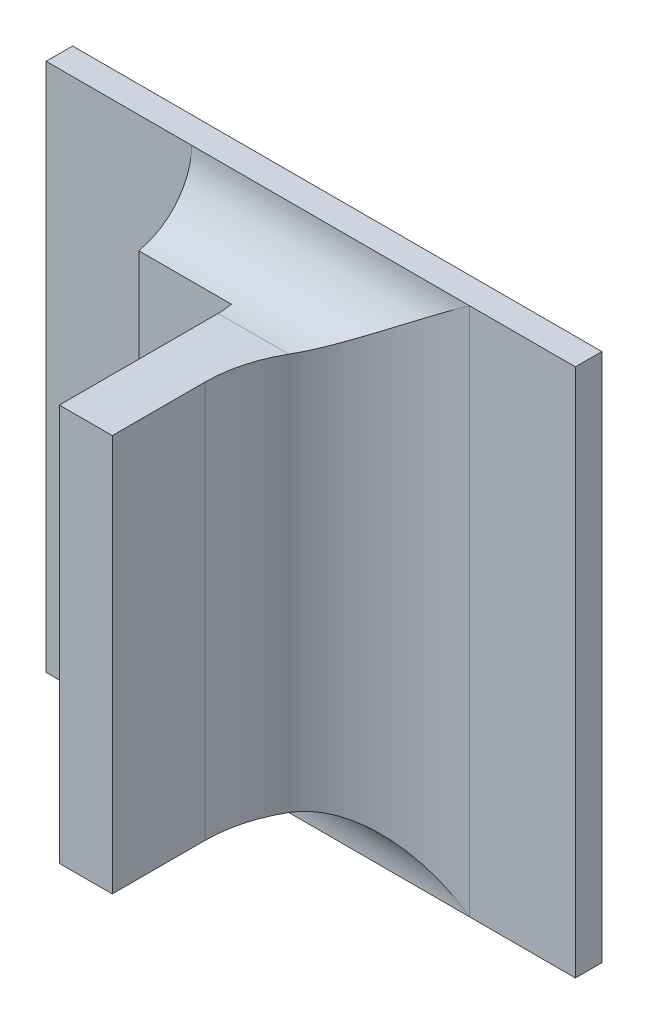
ISO-10303-21;
HEADER;
FILE_DESCRIPTION(('STEP AP214'),'2;1');
FILE_NAME('part.step','',(''),(''),'','','');
FILE_SCHEMA(('AUTOMOTIVE_DESIGN { 1 0 10303 214 1 1 1 1 }'));
ENDSEC;
DATA;
#1=APPLICATION_CONTEXT('core data for automotive mechanical design processes');
#2=APPLICATION_PROTOCOL_DEFINITION('international standard','automotive_design',2000,#1);
#3=PRODUCT_CONTEXT('',#1,'mechanical');
#4=PRODUCT('Part','Part','',(#3));
#5=PRODUCT_RELATED_PRODUCT_CATEGORY('part','',(#4));
#6=PRODUCT_DEFINITION_FORMATION('','',#4);
#7=PRODUCT_DEFINITION_CONTEXT('part definition',#1,'design');
#8=PRODUCT_DEFINITION('design','',#6,#7);
#9=PRODUCT_DEFINITION_SHAPE('','',#8);
#10=(LENGTH_UNIT() NAMED_UNIT(*) SI_UNIT(.MILLI.,.METRE.));
#11=(NAMED_UNIT(*) PLANE_ANGLE_UNIT() SI_UNIT($,.RADIAN.));
#12=(NAMED_UNIT(*) SI_UNIT($,.STERADIAN.) SOLID_ANGLE_UNIT());
#13=UNCERTAINTY_MEASURE_WITH_UNIT(LENGTH_MEASURE(1.E-05),#10,'distance_accuracy_value','');
#14=(GEOMETRIC_REPRESENTATION_CONTEXT(3) GLOBAL_UNCERTAINTY_ASSIGNED_CONTEXT((#13)) GLOBAL_UNIT_ASSIGNED_CONTEXT((#10,
#11,#12)) REPRESENTATION_CONTEXT('',''));
#15=CARTESIAN_POINT('',(0.,0.,0.));
#16=DIRECTION('',(0.,0.,1.));
#17=DIRECTION('',(1.,0.,0.));
#18=AXIS2_PLACEMENT_3D('',#15,#16,#17);
#19=CARTESIAN_POINT('',(-0.924341450663713,-0.311549667580546,0.0796271653543306));
#20=DIRECTION('',(-1.,0.,0.));
#21=DIRECTION('',(0.,-1.,0.));
#22=AXIS2_PLACEMENT_3D('',#19,#20,#21);
#23=PLANE('',#22);
#24=DIRECTION('',(0.,-1.,0.));
#25=VECTOR('',#24,1.);
#26=CARTESIAN_POINT('',(-0.924341450663713,-0.36005360458842,0.0800681102362204));
#27=LINE('',#26,#25);
#28=CARTESIAN_POINT('',(-0.924341450663713,-0.351234706950624,0.0800681102362204));
#29=VERTEX_POINT('',#28);
#30=CARTESIAN_POINT('',(-0.924341450663713,-0.313439431360073,0.0800681102362204));
#31=VERTEX_POINT('',#30);
#32=EDGE_CURVE('E116',#29,#31,#27,.F.);
#33=ORIENTED_EDGE('',*,*,#32,.T.);
#34=DIRECTION('',(0.,0.,1.));
#35=VECTOR('',#34,1.);
#36=CARTESIAN_POINT('',(-0.924341450663713,-0.313439431360073,0.0730129921259841));
#37=LINE('',#36,#35);
#38=CARTESIAN_POINT('',(-0.924341450663713,-0.313439431360073,0.0888870078740156));
#39=VERTEX_POINT('',#38);
#40=EDGE_CURVE('E294',#39,#31,#37,.F.);
#41=ORIENTED_EDGE('',*,*,#40,.F.);
#42=DIRECTION('',(0.,1.,0.));
#43=VECTOR('',#42,1.);
#44=CARTESIAN_POINT('',(-0.924341450663713,-0.311549667580546,0.0888870078740156));
#45=LINE('',#44,#43);
#46=CARTESIAN_POINT('',(-0.924341450663713,-0.351234706950624,0.0888870078740156));
#47=VERTEX_POINT('',#46);
#48=EDGE_CURVE('E306',#39,#47,#45,.F.);
#49=ORIENTED_EDGE('',*,*,#48,.T.);
#50=DIRECTION('',(0.,0.,1.));
#51=VECTOR('',#50,1.);
#52=CARTESIAN_POINT('',(-0.924341450663713,-0.351234706950624,0.0730129921259841));
#53=LINE('',#52,#51);
#54=EDGE_CURVE('E305',#47,#29,#53,.F.);
#55=ORIENTED_EDGE('',*,*,#54,.T.);
#56=EDGE_LOOP('',(#33,#41,#49,#55));
#57=FACE_BOUND('',#56,.T.);
#58=ADVANCED_FACE('F17',(#57),#23,.F.);
#59=CARTESIAN_POINT('',(-0.92963278924639,-0.311549667580546,0.0888870078740156));
#60=DIRECTION('',(0.,0.,-1.));
#61=DIRECTION('',(-1.,0.,0.));
#62=AXIS2_PLACEMENT_3D('',#59,#60,#61);
#63=PLANE('',#62);
#64=DIRECTION('',(0.,1.,0.));
#65=VECTOR('',#64,1.);
#66=CARTESIAN_POINT('',(-0.929380820742453,-0.35326446766354,0.0888870078740156));
#67=LINE('',#66,#65);
#68=CARTESIAN_POINT('',(-0.929380820742453,-0.313439431360073,0.0888870078740156));
#69=VERTEX_POINT('',#68);
#70=CARTESIAN_POINT('',(-0.929380820742453,-0.351234706950624,0.0888870078740156));
#71=VERTEX_POINT('',#70);
#72=EDGE_CURVE('E297',#69,#71,#67,.F.);
#73=ORIENTED_EDGE('',*,*,#72,.T.);
#74=DIRECTION('',(-1.,0.,0.));
#75=VECTOR('',#74,1.);
#76=CARTESIAN_POINT('',(-0.922317219784641,-0.351234706950624,0.0888870078740156));
#77=LINE('',#76,#75);
#78=EDGE_CURVE('E302',#71,#47,#77,.F.);
#79=ORIENTED_EDGE('',*,*,#78,.T.);
#80=ORIENTED_EDGE('',*,*,#48,.F.);
#81=DIRECTION('',(-1.,0.,0.));
#82=VECTOR('',#81,1.);
#83=CARTESIAN_POINT('',(-0.922317219784641,-0.313439431360073,0.0888870078740156));
#84=LINE('',#83,#82);
#85=EDGE_CURVE('E291',#69,#39,#84,.F.);
#86=ORIENTED_EDGE('',*,*,#85,.F.);
#87=EDGE_LOOP('',(#73,#79,#80,#86));
#88=FACE_BOUND('',#87,.T.);
#89=ADVANCED_FACE('F321',(#88),#63,.F.);
#90=CARTESIAN_POINT('',(-0.922317219784641,-0.351234706950624,0.0730129921259841));
#91=DIRECTION('',(0.,1.,0.));
#92=DIRECTION('',(-1.,0.,0.));
#93=AXIS2_PLACEMENT_3D('',#90,#91,#92);
#94=PLANE('',#93);
#95=DIRECTION('',(-1.,0.,0.));
#96=VECTOR('',#95,1.);
#97=CARTESIAN_POINT('',(-0.964656411293634,-0.351234706950625,0.0737688976377952));
#98=LINE('',#97,#96);
#99=CARTESIAN_POINT('',(-0.929380820742453,-0.351234706950624,0.0737688976377952));
#100=VERTEX_POINT('',#99);
#101=CARTESIAN_POINT('',(-0.922653581735013,-0.351234706950624,0.0737688976377951));
#102=VERTEX_POINT('',#101);
#103=EDGE_CURVE('E127',#100,#102,#98,.F.);
#104=ORIENTED_EDGE('',*,*,#103,.T.);
#105=CARTESIAN_POINT('',(-0.911743025466863,-0.351234706950624,0.0800681102362204));
#106=DIRECTION('',(0.,-1.,0.));
#107=DIRECTION('',(1.,0.,0.));
#108=AXIS2_PLACEMENT_3D('',#105,#106,#107);
#109=CIRCLE('',#108,0.0125984251968504);
#110=EDGE_CURVE('E20',#102,#29,#109,.F.);
#111=ORIENTED_EDGE('',*,*,#110,.T.);
#112=ORIENTED_EDGE('',*,*,#54,.F.);
#113=ORIENTED_EDGE('',*,*,#78,.F.);
#114=DIRECTION('',(0.,0.,1.));
#115=VECTOR('',#114,1.);
#116=CARTESIAN_POINT('',(-0.929380820742453,-0.351234706950624,0.0716901574803148));
#117=LINE('',#116,#115);
#118=EDGE_CURVE('E135',#71,#100,#117,.F.);
#119=ORIENTED_EDGE('',*,*,#118,.T.);
#120=EDGE_LOOP('',(#104,#111,#112,#113,#119));
#121=FACE_BOUND('',#120,.T.);
#122=ADVANCED_FACE('F133',(#121),#94,.F.);
#123=CARTESIAN_POINT('',(-0.938640663262138,-0.311409670647157,0.0725090551181101));
#124=DIRECTION('',(0.,0.,-1.));
#125=DIRECTION('',(-1.,0.,0.));
#126=AXIS2_PLACEMENT_3D('',#123,#124,#125);
#127=PLANE('',#126);
#128=DIRECTION('',(1.,0.,0.));
#129=VECTOR('',#128,1.);
#130=CARTESIAN_POINT('',(-0.910420190821193,-0.313312161420629,0.0725090551181101));
#131=LINE('',#130,#129);
#132=CARTESIAN_POINT('',(-0.929380820742453,-0.313312161420629,0.0725090551181101));
#133=VERTEX_POINT('',#132);
#134=CARTESIAN_POINT('',(-0.938199718380249,-0.313312161420629,0.0725090551181101));
#135=VERTEX_POINT('',#134);
#136=EDGE_CURVE('E142',#133,#135,#131,.F.);
#137=ORIENTED_EDGE('',*,*,#136,.T.);
#138=DIRECTION('',(0.,1.,0.));
#139=VECTOR('',#138,1.);
#140=CARTESIAN_POINT('',(-0.938199718380249,-0.304620533722278,0.0725090551181101));
#141=LINE('',#140,#139);
#142=CARTESIAN_POINT('',(-0.938199718380249,-0.351361976890069,0.0725090551181102));
#143=VERTEX_POINT('',#142);
#144=EDGE_CURVE('E146',#135,#143,#141,.F.);
#145=ORIENTED_EDGE('',*,*,#144,.T.);
#146=DIRECTION('',(-1.,0.,0.));
#147=VECTOR('',#146,1.);
#148=CARTESIAN_POINT('',(-0.964656411293634,-0.351361976890069,0.0725090551181103));
#149=LINE('',#148,#147);
#150=CARTESIAN_POINT('',(-0.929380820742453,-0.351361976890068,0.0725090551181101));
#151=VERTEX_POINT('',#150);
#152=EDGE_CURVE('E138',#143,#151,#149,.F.);
#153=ORIENTED_EDGE('',*,*,#152,.T.);
#154=DIRECTION('',(0.,1.,0.));
#155=VECTOR('',#154,1.);
#156=CARTESIAN_POINT('',(-0.929380820742453,-0.35326446766354,0.0725090551181101));
#157=LINE('',#156,#155);
#158=EDGE_CURVE('E324',#151,#133,#157,.T.);
#159=ORIENTED_EDGE('',*,*,#158,.T.);
#160=EDGE_LOOP('',(#137,#145,#153,#159));
#161=FACE_BOUND('',#160,.T.);
#162=ADVANCED_FACE('F193',(#161),#127,.F.);
#163=CARTESIAN_POINT('',(-0.911743025466863,-0.36005360458842,0.0800681102362204));
#164=DIRECTION('',(0.,-1.,0.));
#165=DIRECTION('',(1.,0.,0.));
#166=AXIS2_PLACEMENT_3D('',#163,#164,#165);
#167=CYLINDRICAL_SURFACE('',#166,0.0125984251968504);
#168=CARTESIAN_POINT('',(-0.922653581735013,-0.351234706950625,0.073768897637795));
#169=CARTESIAN_POINT('',(-0.922381097230534,-0.351235264602845,0.0732955457546591));
#170=CARTESIAN_POINT('',(-0.92207898510493,-0.351287791933284,0.0728445682080297));
#171=CARTESIAN_POINT('',(-0.921433517330929,-0.351472774611582,0.0720003898002663));
#172=CARTESIAN_POINT('',(-0.921090784855673,-0.351604122731852,0.0716064807283954));
#173=CARTESIAN_POINT('',(-0.920305547730899,-0.351954482138245,0.0708064921171964));
#174=CARTESIAN_POINT('',(-0.919856476602596,-0.35218542937407,0.0704123993317733));
#175=CARTESIAN_POINT('',(-0.918926550340997,-0.352703528005896,0.0697017381084181));
#176=CARTESIAN_POINT('',(-0.918445517070301,-0.35299101561292,0.0693856602556568));
#177=CARTESIAN_POINT('',(-0.917264779625798,-0.353727172372373,0.0687164538298326));
#178=CARTESIAN_POINT('',(-0.916555502514436,-0.354193928271792,0.0684002761150405));
#179=CARTESIAN_POINT('',(-0.91511847479958,-0.355165489292897,0.0679065689436589));
#180=CARTESIAN_POINT('',(-0.914390756039803,-0.355670231444698,0.0677288153407497));
#181=CARTESIAN_POINT('',(-0.913214793470324,-0.356494415867954,0.0675478835698786));
#182=CARTESIAN_POINT('',(-0.912768938686053,-0.356808848945619,0.0675035718032502));
#183=CARTESIAN_POINT('',(-0.912129517641484,-0.357260628255394,0.0674741343290926));
#184=CARTESIAN_POINT('',(-0.911936266991823,-0.357397277676519,0.0674696949622004));
#185=CARTESIAN_POINT('',(-0.911743025466863,-0.35753391954905,0.06746968503937));
#186=B_SPLINE_CURVE_WITH_KNOTS('',3,(#168,#169,#170,#171,#172,#173,#174,#175,#176,#177,#178,
#179,#180,#181,#182,#183,#184,#185),.UNSPECIFIED.,.F.,.F.,(4,2,2,2,2,2,2,2,4),(0.,
0.00162828046163537,0.00323420635682061,0.00514617952943932,0.00706988591555795,
0.00977367423346207,0.0124730752253369,0.0141132082090726,0.0148232188039429),.UNSPECIFIED.);
#187=CARTESIAN_POINT('',(-0.911743025466863,-0.35753391954905,0.06746968503937));
#188=VERTEX_POINT('',#187);
#189=EDGE_CURVE('E113',#102,#188,#186,.T.);
#190=ORIENTED_EDGE('',*,*,#189,.T.);
#191=DIRECTION('',(0.,1.,0.));
#192=VECTOR('',#191,1.);
#193=CARTESIAN_POINT('',(-0.911743025466863,-0.304620533722278,0.06746968503937));
#194=LINE('',#193,#192);
#195=CARTESIAN_POINT('',(-0.911743025466863,-0.307140218761648,0.06746968503937));
#196=VERTEX_POINT('',#195);
#197=EDGE_CURVE('E279',#196,#188,#194,.F.);
#198=ORIENTED_EDGE('',*,*,#197,.F.);
#199=CARTESIAN_POINT('',(-0.922653581735013,-0.313439431360073,0.073768897637795));
#200=CARTESIAN_POINT('',(-0.922381097230534,-0.313438873707853,0.0732955457546591));
#201=CARTESIAN_POINT('',(-0.92207898510493,-0.313386346377414,0.0728445682080297));
#202=CARTESIAN_POINT('',(-0.921433517330929,-0.313201363699116,0.0720003898002663));
#203=CARTESIAN_POINT('',(-0.921090784855673,-0.313070015578846,0.0716064807283955));
#204=CARTESIAN_POINT('',(-0.920305547730899,-0.312719656172453,0.0708064921171964));
#205=CARTESIAN_POINT('',(-0.919856476602596,-0.312488708936628,0.0704123993317733));
#206=CARTESIAN_POINT('',(-0.918926550340997,-0.311970610304802,0.0697017381084181));
#207=CARTESIAN_POINT('',(-0.918445517070301,-0.311683122697778,0.0693856602556568));
#208=CARTESIAN_POINT('',(-0.917264779625798,-0.310946965938325,0.0687164538298325));
#209=CARTESIAN_POINT('',(-0.916555502514436,-0.310480210038906,0.0684002761150404));
#210=CARTESIAN_POINT('',(-0.915118474799579,-0.309508649017801,0.0679065689436589));
#211=CARTESIAN_POINT('',(-0.914390756039802,-0.309003906866,0.0677288153407497));
#212=CARTESIAN_POINT('',(-0.913214793470323,-0.308179722442743,0.0675478835698786));
#213=CARTESIAN_POINT('',(-0.912768938686053,-0.307865289365079,0.0675035718032502));
#214=CARTESIAN_POINT('',(-0.912129517641484,-0.307413510055304,0.0674741343290926));
#215=CARTESIAN_POINT('',(-0.911936266991823,-0.307276860634179,0.0674696949622004));
#216=CARTESIAN_POINT('',(-0.911743025466863,-0.307140218761648,0.06746968503937));
#217=B_SPLINE_CURVE_WITH_KNOTS('',3,(#199,#200,#201,#202,#203,#204,#205,#206,#207,#208,#209,
#210,#211,#212,#213,#214,#215,#216),.UNSPECIFIED.,.F.,.F.,(4,2,2,2,2,2,2,2,4),(0.,
0.00162828046163538,0.00323420635682063,0.00514617952943933,0.00706988591555797,
0.00977367423346225,0.012473075225337,0.0141132082090727,0.0148232188039429),.UNSPECIFIED.);
#218=CARTESIAN_POINT('',(-0.922653581735013,-0.313439431360073,0.0737688976377952));
#219=VERTEX_POINT('',#218);
#220=EDGE_CURVE('E197',#196,#219,#217,.F.);
#221=ORIENTED_EDGE('',*,*,#220,.T.);
#222=CARTESIAN_POINT('',(-0.911743025466863,-0.313439431360073,0.0800681102362204));
#223=DIRECTION('',(0.,1.,0.));
#224=DIRECTION('',(-1.,0.,0.));
#225=AXIS2_PLACEMENT_3D('',#222,#223,#224);
#226=CIRCLE('',#225,0.0125984251968504);
#227=EDGE_CURVE('E121',#31,#219,#226,.F.);
#228=ORIENTED_EDGE('',*,*,#227,.F.);
#229=ORIENTED_EDGE('',*,*,#32,.F.);
#230=ORIENTED_EDGE('',*,*,#110,.F.);
#231=EDGE_LOOP('',(#190,#198,#221,#228,#229,#230));
#232=FACE_BOUND('',#231,.T.);
#233=ADVANCED_FACE('F111',(#232),#167,.F.);
#234=CARTESIAN_POINT('',(-0.922317219784641,-0.313439431360073,0.0730129921259841));
#235=DIRECTION('',(0.,1.,0.));
#236=DIRECTION('',(-1.,0.,0.));
#237=AXIS2_PLACEMENT_3D('',#234,#235,#236);
#238=PLANE('',#237);
#239=ORIENTED_EDGE('',*,*,#85,.T.);
#240=ORIENTED_EDGE('',*,*,#40,.T.);
#241=ORIENTED_EDGE('',*,*,#227,.T.);
#242=DIRECTION('',(1.,0.,0.));
#243=VECTOR('',#242,1.);
#244=CARTESIAN_POINT('',(-0.910420190821193,-0.313439431360073,0.0737688976377952));
#245=LINE('',#244,#243);
#246=CARTESIAN_POINT('',(-0.929380820742453,-0.313439431360073,0.0737688976377952));
#247=VERTEX_POINT('',#246);
#248=EDGE_CURVE('E266',#219,#247,#245,.F.);
#249=ORIENTED_EDGE('',*,*,#248,.T.);
#250=DIRECTION('',(0.,0.,1.));
#251=VECTOR('',#250,1.);
#252=CARTESIAN_POINT('',(-0.929380820742453,-0.313439431360073,0.0716901574803148));
#253=LINE('',#252,#251);
#254=EDGE_CURVE('E149',#247,#69,#253,.T.);
#255=ORIENTED_EDGE('',*,*,#254,.T.);
#256=EDGE_LOOP('',(#239,#240,#241,#249,#255));
#257=FACE_BOUND('',#256,.T.);
#258=ADVANCED_FACE('F183',(#257),#238,.T.);
#259=CARTESIAN_POINT('',(-0.929380820742453,-0.35326446766354,0.0716901574803148));
#260=DIRECTION('',(1.,0.,0.));
#261=DIRECTION('',(0.,1.,0.));
#262=AXIS2_PLACEMENT_3D('',#259,#260,#261);
#263=PLANE('',#262);
#264=CARTESIAN_POINT('',(-0.929380820742453,-0.313312161420629,0.0725090551181101));
#265=CARTESIAN_POINT('',(-0.929380820742453,-0.313439431360073,0.0731325479405746));
#266=CARTESIAN_POINT('',(-0.929380820742453,-0.313439431360073,0.0737688976377952));
#267=B_SPLINE_CURVE_WITH_KNOTS('',2,(#264,#265,#266),.UNSPECIFIED.,.F.,.F.,(3,3),(0.,1.),.UNSPECIFIED.);
#268=EDGE_CURVE('E153',#247,#133,#267,.F.);
#269=ORIENTED_EDGE('',*,*,#268,.T.);
#270=ORIENTED_EDGE('',*,*,#158,.F.);
#271=CARTESIAN_POINT('',(-0.929380820742453,-0.351234706950624,0.0737688976377952));
#272=CARTESIAN_POINT('',(-0.929380820742453,-0.351234706950624,0.0731325479405795));
#273=CARTESIAN_POINT('',(-0.929380820742453,-0.351361976890068,0.0725090551181101));
#274=B_SPLINE_CURVE_WITH_KNOTS('',2,(#271,#272,#273),.UNSPECIFIED.,.F.,.F.,(3,3),(0.,1.),.UNSPECIFIED.);
#275=EDGE_CURVE('E136',#151,#100,#274,.F.);
#276=ORIENTED_EDGE('',*,*,#275,.T.);
#277=ORIENTED_EDGE('',*,*,#118,.F.);
#278=ORIENTED_EDGE('',*,*,#72,.F.);
#279=ORIENTED_EDGE('',*,*,#254,.F.);
#280=EDGE_LOOP('',(#269,#270,#276,#277,#278,#279));
#281=FACE_BOUND('',#280,.T.);
#282=ADVANCED_FACE('F172',(#281),#263,.F.);
#283=CARTESIAN_POINT('',(-0.938199718380249,-0.304620533722278,0.067217716535433));
#284=DIRECTION('',(1.,0.,0.));
#285=DIRECTION('',(0.,1.,0.));
#286=AXIS2_PLACEMENT_3D('',#283,#284,#285);
#287=PLANE('',#286);
#288=CARTESIAN_POINT('',(-0.938199718380249,-0.307140218761648,0.0737688976377952));
#289=DIRECTION('',(1.,0.,0.));
#290=DIRECTION('',(0.,1.,0.));
#291=AXIS2_PLACEMENT_3D('',#288,#289,#290);
#292=CIRCLE('',#291,0.0062992125984252);
#293=CARTESIAN_POINT('',(-0.938199718380249,-0.307140218761648,0.06746968503937));
#294=VERTEX_POINT('',#293);
#295=EDGE_CURVE('E272',#135,#294,#292,.T.);
#296=ORIENTED_EDGE('',*,*,#295,.T.);
#297=DIRECTION('',(0.,1.,0.));
#298=VECTOR('',#297,1.);
#299=CARTESIAN_POINT('',(-0.938199718380249,-0.304620533722278,0.06746968503937));
#300=LINE('',#299,#298);
#301=CARTESIAN_POINT('',(-0.938199718380249,-0.35753391954905,0.06746968503937));
#302=VERTEX_POINT('',#301);
#303=EDGE_CURVE('E150',#302,#294,#300,.T.);
#304=ORIENTED_EDGE('',*,*,#303,.F.);
#305=CARTESIAN_POINT('',(-0.938199718380249,-0.35753391954905,0.0737688976377952));
#306=DIRECTION('',(-1.,0.,0.));
#307=DIRECTION('',(0.,-1.,0.));
#308=AXIS2_PLACEMENT_3D('',#305,#306,#307);
#309=CIRCLE('',#308,0.0062992125984252);
#310=EDGE_CURVE('E131',#302,#143,#309,.F.);
#311=ORIENTED_EDGE('',*,*,#310,.T.);
#312=ORIENTED_EDGE('',*,*,#144,.F.);
#313=EDGE_LOOP('',(#296,#304,#311,#312));
#314=FACE_BOUND('',#313,.T.);
#315=ADVANCED_FACE('F182',(#314),#287,.F.);
#316=CARTESIAN_POINT('',(-0.964656411293634,-0.35753391954905,0.0737688976377952));
#317=DIRECTION('',(-1.,0.,0.));
#318=DIRECTION('',(0.,-1.,0.));
#319=AXIS2_PLACEMENT_3D('',#316,#317,#318);
#320=CYLINDRICAL_SURFACE('',#319,0.0062992125984252);
#321=DIRECTION('',(-1.,0.,0.));
#322=VECTOR('',#321,1.);
#323=CARTESIAN_POINT('',(-0.899144600270013,-0.35753391954905,0.06746968503937));
#324=LINE('',#323,#322);
#325=EDGE_CURVE('E130',#302,#188,#324,.F.);
#326=ORIENTED_EDGE('',*,*,#325,.T.);
#327=ORIENTED_EDGE('',*,*,#189,.F.);
#328=ORIENTED_EDGE('',*,*,#103,.F.);
#329=ORIENTED_EDGE('',*,*,#275,.F.);
#330=ORIENTED_EDGE('',*,*,#152,.F.);
#331=ORIENTED_EDGE('',*,*,#310,.F.);
#332=EDGE_LOOP('',(#326,#327,#328,#329,#330,#331));
#333=FACE_BOUND('',#332,.T.);
#334=ADVANCED_FACE('F125',(#333),#320,.F.);
#335=CARTESIAN_POINT('',(-0.901160348301508,-0.304620533722278,0.06746968503937));
#336=DIRECTION('',(0.,0.,1.));
#337=DIRECTION('',(1.,0.,0.));
#338=AXIS2_PLACEMENT_3D('',#335,#336,#337);
#339=PLANE('',#338);
#340=DIRECTION('',(0.,-1.,0.));
#341=VECTOR('',#340,1.);
#342=CARTESIAN_POINT('',(-0.901664285309383,-0.304620533722278,0.06746968503937));
#343=LINE('',#342,#341);
#344=CARTESIAN_POINT('',(-0.901664285309383,-0.35753391954905,0.06746968503937));
#345=VERTEX_POINT('',#344);
#346=CARTESIAN_POINT('',(-0.901664285309383,-0.307140218761648,0.06746968503937));
#347=VERTEX_POINT('',#346);
#348=EDGE_CURVE('E262',#345,#347,#343,.F.);
#349=ORIENTED_EDGE('',*,*,#348,.T.);
#350=DIRECTION('',(1.,0.,0.));
#351=VECTOR('',#350,1.);
#352=CARTESIAN_POINT('',(-0.954577671136154,-0.307140218761648,0.06746968503937));
#353=LINE('',#352,#351);
#354=EDGE_CURVE('E166',#347,#196,#353,.F.);
#355=ORIENTED_EDGE('',*,*,#354,.T.);
#356=ORIENTED_EDGE('',*,*,#197,.T.);
#357=DIRECTION('',(-1.,0.,0.));
#358=VECTOR('',#357,1.);
#359=CARTESIAN_POINT('',(-0.899144600270013,-0.35753391954905,0.06746968503937));
#360=LINE('',#359,#358);
#361=EDGE_CURVE('E155',#188,#345,#360,.F.);
#362=ORIENTED_EDGE('',*,*,#361,.T.);
#363=EDGE_LOOP('',(#349,#355,#356,#362));
#364=FACE_BOUND('',#363,.T.);
#365=ADVANCED_FACE('F211',(#364),#339,.T.);
#366=CARTESIAN_POINT('',(-0.910420190821193,-0.307140218761648,0.0737688976377952));
#367=DIRECTION('',(1.,0.,0.));
#368=DIRECTION('',(0.,1.,0.));
#369=AXIS2_PLACEMENT_3D('',#366,#367,#368);
#370=CYLINDRICAL_SURFACE('',#369,0.0062992125984252);
#371=ORIENTED_EDGE('',*,*,#248,.F.);
#372=ORIENTED_EDGE('',*,*,#220,.F.);
#373=DIRECTION('',(1.,0.,0.));
#374=VECTOR('',#373,1.);
#375=CARTESIAN_POINT('',(-0.954577671136154,-0.307140218761648,0.06746968503937));
#376=LINE('',#375,#374);
#377=EDGE_CURVE('E164',#196,#294,#376,.F.);
#378=ORIENTED_EDGE('',*,*,#377,.T.);
#379=ORIENTED_EDGE('',*,*,#295,.F.);
#380=ORIENTED_EDGE('',*,*,#136,.F.);
#381=ORIENTED_EDGE('',*,*,#268,.F.);
#382=EDGE_LOOP('',(#371,#372,#378,#379,#380,#381));
#383=FACE_BOUND('',#382,.T.);
#384=ADVANCED_FACE('F213',(#383),#370,.F.);
#385=CARTESIAN_POINT('',(-0.937506804994422,-0.304620533722278,0.06746968503937));
#386=DIRECTION('',(0.,0.,1.));
#387=DIRECTION('',(1.,0.,0.));
#388=AXIS2_PLACEMENT_3D('',#385,#386,#387);
#389=PLANE('',#388);
#390=DIRECTION('',(1.,0.,0.));
#391=VECTOR('',#390,1.);
#392=CARTESIAN_POINT('',(-0.954577671136154,-0.307140218761648,0.06746968503937));
#393=LINE('',#392,#391);
#394=CARTESIAN_POINT('',(-0.952057986096784,-0.307140218761648,0.06746968503937));
#395=VERTEX_POINT('',#394);
#396=EDGE_CURVE('E160',#294,#395,#393,.F.);
#397=ORIENTED_EDGE('',*,*,#396,.T.);
#398=DIRECTION('',(0.,1.,0.));
#399=VECTOR('',#398,1.);
#400=CARTESIAN_POINT('',(-0.952057986096784,-0.36005360458842,0.06746968503937));
#401=LINE('',#400,#399);
#402=CARTESIAN_POINT('',(-0.952057986096784,-0.35753391954905,0.06746968503937));
#403=VERTEX_POINT('',#402);
#404=EDGE_CURVE('E152',#395,#403,#401,.F.);
#405=ORIENTED_EDGE('',*,*,#404,.T.);
#406=DIRECTION('',(-1.,0.,0.));
#407=VECTOR('',#406,1.);
#408=CARTESIAN_POINT('',(-0.899144600270013,-0.35753391954905,0.06746968503937));
#409=LINE('',#408,#407);
#410=EDGE_CURVE('E156',#403,#302,#409,.F.);
#411=ORIENTED_EDGE('',*,*,#410,.T.);
#412=ORIENTED_EDGE('',*,*,#303,.T.);
#413=EDGE_LOOP('',(#397,#405,#411,#412));
#414=FACE_BOUND('',#413,.T.);
#415=ADVANCED_FACE('F218',(#414),#389,.T.);
#416=CARTESIAN_POINT('',(-0.952057986096784,-0.36005360458842,0.0648240157480314));
#417=DIRECTION('',(1.,0.,0.));
#418=DIRECTION('',(0.,1.,0.));
#419=AXIS2_PLACEMENT_3D('',#416,#417,#418);
#420=PLANE('',#419);
#421=DIRECTION('',(0.,0.,1.));
#422=VECTOR('',#421,1.);
#423=CARTESIAN_POINT('',(-0.952057986096784,-0.35753391954905,0.0648240157480314));
#424=LINE('',#423,#422);
#425=CARTESIAN_POINT('',(-0.952057986096784,-0.35753391954905,0.0649499999999999));
#426=VERTEX_POINT('',#425);
#427=EDGE_CURVE('E159',#426,#403,#424,.T.);
#428=ORIENTED_EDGE('',*,*,#427,.T.);
#429=ORIENTED_EDGE('',*,*,#404,.F.);
#430=DIRECTION('',(0.,0.,1.));
#431=VECTOR('',#430,1.);
#432=CARTESIAN_POINT('',(-0.952057986096784,-0.307140218761648,0.0648240157480314));
#433=LINE('',#432,#431);
#434=CARTESIAN_POINT('',(-0.952057986096784,-0.307140218761648,0.0649499999999999));
#435=VERTEX_POINT('',#434);
#436=EDGE_CURVE('E163',#395,#435,#433,.F.);
#437=ORIENTED_EDGE('',*,*,#436,.T.);
#438=DIRECTION('',(0.,1.,0.));
#439=VECTOR('',#438,1.);
#440=CARTESIAN_POINT('',(-0.952057986096784,-0.304620533722278,0.0649499999999999));
#441=LINE('',#440,#439);
#442=EDGE_CURVE('E255',#435,#426,#441,.F.);
#443=ORIENTED_EDGE('',*,*,#442,.T.);
#444=EDGE_LOOP('',(#428,#429,#437,#443));
#445=FACE_BOUND('',#444,.T.);
#446=ADVANCED_FACE('F222',(#445),#420,.F.);
#447=CARTESIAN_POINT('',(-0.899144600270013,-0.35753391954905,0.0648240157480314));
#448=DIRECTION('',(0.,1.,0.));
#449=DIRECTION('',(-1.,0.,0.));
#450=AXIS2_PLACEMENT_3D('',#447,#448,#449);
#451=PLANE('',#450);
#452=DIRECTION('',(0.,0.,1.));
#453=VECTOR('',#452,1.);
#454=CARTESIAN_POINT('',(-0.901664285309383,-0.35753391954905,0.0648240157480314));
#455=LINE('',#454,#453);
#456=CARTESIAN_POINT('',(-0.901664285309383,-0.35753391954905,0.0649499999999999));
#457=VERTEX_POINT('',#456);
#458=EDGE_CURVE('E252',#457,#345,#455,.T.);
#459=ORIENTED_EDGE('',*,*,#458,.T.);
#460=ORIENTED_EDGE('',*,*,#361,.F.);
#461=ORIENTED_EDGE('',*,*,#325,.F.);
#462=ORIENTED_EDGE('',*,*,#410,.F.);
#463=ORIENTED_EDGE('',*,*,#427,.F.);
#464=DIRECTION('',(1.,0.,0.));
#465=VECTOR('',#464,1.);
#466=CARTESIAN_POINT('',(-0.899144600270013,-0.35753391954905,0.0649499999999999));
#467=LINE('',#466,#465);
#468=EDGE_CURVE('E248',#426,#457,#467,.T.);
#469=ORIENTED_EDGE('',*,*,#468,.T.);
#470=EDGE_LOOP('',(#459,#460,#461,#462,#463,#469));
#471=FACE_BOUND('',#470,.T.);
#472=ADVANCED_FACE('F226',(#471),#451,.F.);
#473=CARTESIAN_POINT('',(-0.901664285309383,-0.304620533722278,0.0648240157480314));
#474=DIRECTION('',(-1.,0.,0.));
#475=DIRECTION('',(0.,-1.,0.));
#476=AXIS2_PLACEMENT_3D('',#473,#474,#475);
#477=PLANE('',#476);
#478=DIRECTION('',(0.,0.,1.));
#479=VECTOR('',#478,1.);
#480=CARTESIAN_POINT('',(-0.901664285309383,-0.307140218761648,0.0648240157480314));
#481=LINE('',#480,#479);
#482=CARTESIAN_POINT('',(-0.901664285309383,-0.307140218761648,0.0649499999999999));
#483=VERTEX_POINT('',#482);
#484=EDGE_CURVE('E34',#483,#347,#481,.T.);
#485=ORIENTED_EDGE('',*,*,#484,.T.);
#486=ORIENTED_EDGE('',*,*,#348,.F.);
#487=ORIENTED_EDGE('',*,*,#458,.F.);
#488=DIRECTION('',(0.,1.,0.));
#489=VECTOR('',#488,1.);
#490=CARTESIAN_POINT('',(-0.901664285309383,-0.304620533722278,0.0649499999999999));
#491=LINE('',#490,#489);
#492=EDGE_CURVE('E26',#457,#483,#491,.T.);
#493=ORIENTED_EDGE('',*,*,#492,.T.);
#494=EDGE_LOOP('',(#485,#486,#487,#493));
#495=FACE_BOUND('',#494,.T.);
#496=ADVANCED_FACE('F230',(#495),#477,.F.);
#497=CARTESIAN_POINT('',(-0.954577671136154,-0.307140218761648,0.0648240157480314));
#498=DIRECTION('',(0.,-1.,0.));
#499=DIRECTION('',(1.,0.,0.));
#500=AXIS2_PLACEMENT_3D('',#497,#498,#499);
#501=PLANE('',#500);
#502=ORIENTED_EDGE('',*,*,#436,.F.);
#503=ORIENTED_EDGE('',*,*,#396,.F.);
#504=ORIENTED_EDGE('',*,*,#377,.F.);
#505=ORIENTED_EDGE('',*,*,#354,.F.);
#506=ORIENTED_EDGE('',*,*,#484,.F.);
#507=DIRECTION('',(1.,0.,0.));
#508=VECTOR('',#507,1.);
#509=CARTESIAN_POINT('',(-0.899144600270013,-0.307140218761648,0.0649499999999999));
#510=LINE('',#509,#508);
#511=EDGE_CURVE('E11',#483,#435,#510,.F.);
#512=ORIENTED_EDGE('',*,*,#511,.T.);
#513=EDGE_LOOP('',(#502,#503,#504,#505,#506,#512));
#514=FACE_BOUND('',#513,.T.);
#515=ADVANCED_FACE('F234',(#514),#501,.F.);
#516=CARTESIAN_POINT('',(-0.899144600270013,-0.304620533722278,0.0649499999999999));
#517=DIRECTION('',(0.,0.,1.));
#518=DIRECTION('',(1.,0.,0.));
#519=AXIS2_PLACEMENT_3D('',#516,#517,#518);
#520=PLANE('',#519);
#521=ORIENTED_EDGE('',*,*,#492,.F.);
#522=ORIENTED_EDGE('',*,*,#468,.F.);
#523=ORIENTED_EDGE('',*,*,#442,.F.);
#524=ORIENTED_EDGE('',*,*,#511,.F.);
#525=EDGE_LOOP('',(#521,#522,#523,#524));
#526=FACE_BOUND('',#525,.T.);
#527=ADVANCED_FACE('F238',(#526),#520,.F.);
#528=CLOSED_SHELL('',(#58,#89,#122,#162,#233,#258,#282,#315,#334,#365,#384,#415,#446,#472,#496,
#515,#527));
#529=MANIFOLD_SOLID_BREP('B1',#528);
#530=ADVANCED_BREP_SHAPE_REPRESENTATION('',(#18,#529),#14);
#531=SHAPE_DEFINITION_REPRESENTATION(#9,#530);
ENDSEC;
END-ISO-10303-21;
